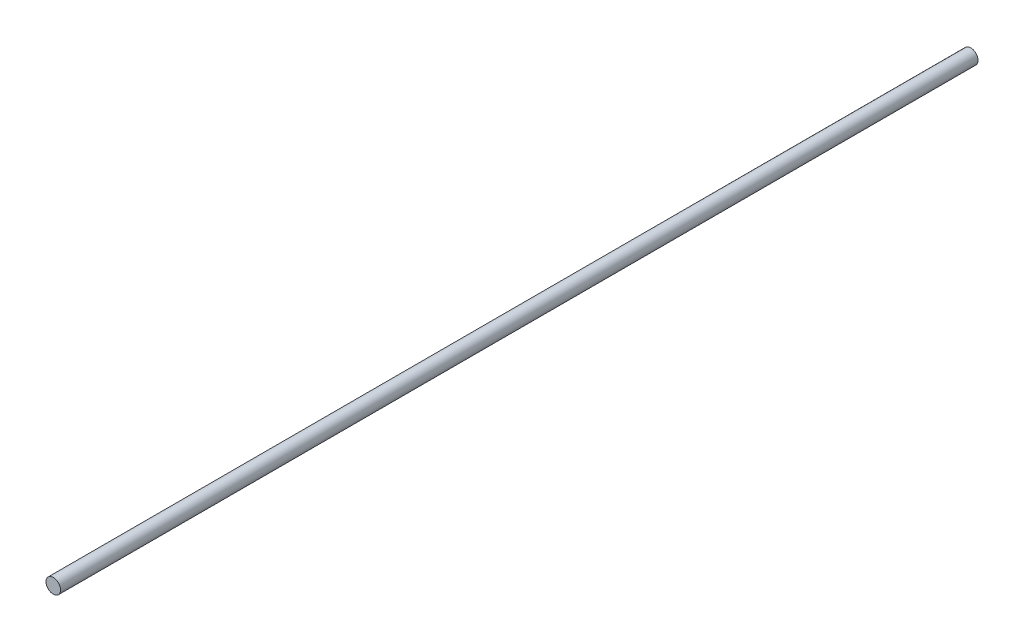
ISO-10303-21;
HEADER;
FILE_DESCRIPTION(('STEP AP214'),'2;1');
FILE_NAME('part.step','',(''),(''),'','','');
FILE_SCHEMA(('AUTOMOTIVE_DESIGN { 1 0 10303 214 1 1 1 1 }'));
ENDSEC;
DATA;
#1=APPLICATION_CONTEXT('core data for automotive mechanical design processes');
#2=APPLICATION_PROTOCOL_DEFINITION('international standard','automotive_design',2000,#1);
#3=PRODUCT_CONTEXT('',#1,'mechanical');
#4=PRODUCT('Part','Part','',(#3));
#5=PRODUCT_RELATED_PRODUCT_CATEGORY('part','',(#4));
#6=PRODUCT_DEFINITION_FORMATION('','',#4);
#7=PRODUCT_DEFINITION_CONTEXT('part definition',#1,'design');
#8=PRODUCT_DEFINITION('design','',#6,#7);
#9=PRODUCT_DEFINITION_SHAPE('','',#8);
#10=(LENGTH_UNIT() NAMED_UNIT(*) SI_UNIT(.MILLI.,.METRE.));
#11=(NAMED_UNIT(*) PLANE_ANGLE_UNIT() SI_UNIT($,.RADIAN.));
#12=(NAMED_UNIT(*) SI_UNIT($,.STERADIAN.) SOLID_ANGLE_UNIT());
#13=UNCERTAINTY_MEASURE_WITH_UNIT(LENGTH_MEASURE(1.E-05),#10,'distance_accuracy_value','');
#14=(GEOMETRIC_REPRESENTATION_CONTEXT(3) GLOBAL_UNCERTAINTY_ASSIGNED_CONTEXT((#13)) GLOBAL_UNIT_ASSIGNED_CONTEXT((#10,
#11,#12)) REPRESENTATION_CONTEXT('',''));
#15=CARTESIAN_POINT('',(0.,0.,0.));
#16=DIRECTION('',(0.,0.,1.));
#17=DIRECTION('',(1.,0.,0.));
#18=AXIS2_PLACEMENT_3D('',#15,#16,#17);
#19=CARTESIAN_POINT('',(0.,0.,500.));
#20=DIRECTION('',(0.,0.,-1.));
#21=DIRECTION('',(-1.,0.,0.));
#22=AXIS2_PLACEMENT_3D('',#19,#20,#21);
#23=CYLINDRICAL_SURFACE('',#22,3.96875);
#24=CARTESIAN_POINT('',(0.,0.,500.));
#25=DIRECTION('',(0.,0.,1.));
#26=DIRECTION('',(1.,0.,0.));
#27=AXIS2_PLACEMENT_3D('',#24,#25,#26);
#28=CIRCLE('',#27,3.96875);
#29=CARTESIAN_POINT('',(3.96875,0.,500.));
#30=VERTEX_POINT('',#29);
#31=EDGE_CURVE('E10',#30,#30,#28,.T.);
#32=ORIENTED_EDGE('',*,*,#31,.F.);
#33=EDGE_LOOP('',(#32));
#34=FACE_BOUND('',#33,.T.);
#35=CARTESIAN_POINT('',(0.,0.,0.));
#36=DIRECTION('',(0.,0.,1.));
#37=DIRECTION('',(1.,0.,0.));
#38=AXIS2_PLACEMENT_3D('',#35,#36,#37);
#39=CIRCLE('',#38,3.96875);
#40=CARTESIAN_POINT('',(3.96875,0.,0.));
#41=VERTEX_POINT('',#40);
#42=EDGE_CURVE('E34',#41,#41,#39,.T.);
#43=ORIENTED_EDGE('',*,*,#42,.T.);
#44=EDGE_LOOP('',(#43));
#45=FACE_BOUND('',#44,.T.);
#46=ADVANCED_FACE('F31',(#34,#45),#23,.T.);
#47=CARTESIAN_POINT('',(0.,0.,500.));
#48=DIRECTION('',(0.,0.,1.));
#49=DIRECTION('',(1.,0.,0.));
#50=AXIS2_PLACEMENT_3D('',#47,#48,#49);
#51=PLANE('',#50);
#52=ORIENTED_EDGE('',*,*,#31,.T.);
#53=EDGE_LOOP('',(#52));
#54=FACE_BOUND('',#53,.T.);
#55=ADVANCED_FACE('F46',(#54),#51,.T.);
#56=CARTESIAN_POINT('',(0.,0.,0.));
#57=DIRECTION('',(0.,0.,1.));
#58=DIRECTION('',(1.,0.,0.));
#59=AXIS2_PLACEMENT_3D('',#56,#57,#58);
#60=PLANE('',#59);
#61=ORIENTED_EDGE('',*,*,#42,.F.);
#62=EDGE_LOOP('',(#61));
#63=FACE_BOUND('',#62,.T.);
#64=ADVANCED_FACE('F44',(#63),#60,.F.);
#65=CLOSED_SHELL('',(#46,#55,#64));
#66=MANIFOLD_SOLID_BREP('B2',#65);
#67=ADVANCED_BREP_SHAPE_REPRESENTATION('',(#18,#66),#14);
#68=SHAPE_DEFINITION_REPRESENTATION(#9,#67);
ENDSEC;
END-ISO-10303-21;
